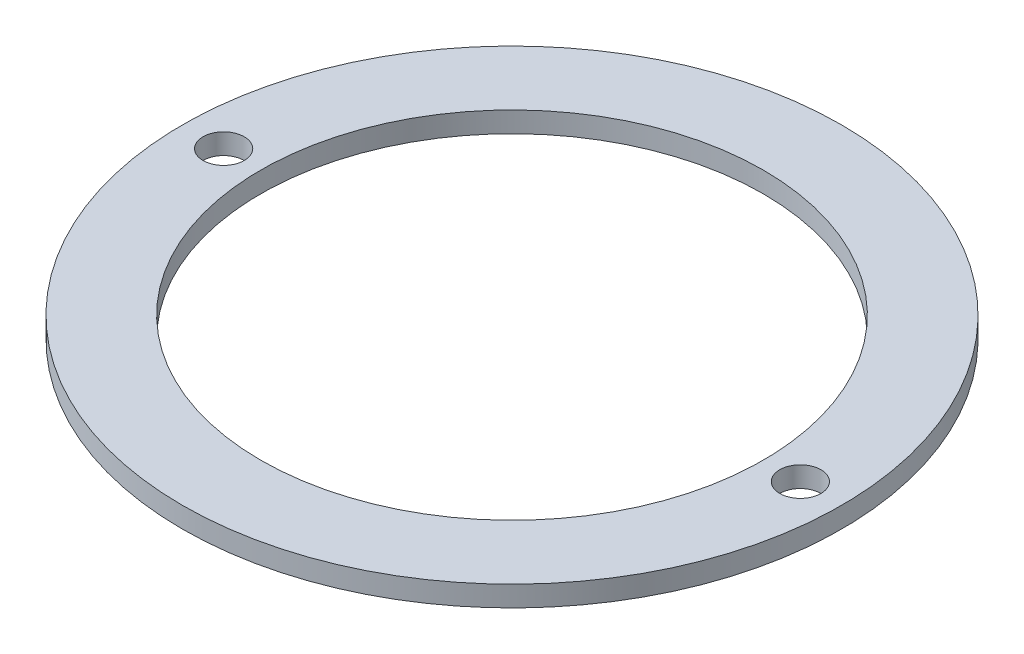
ISO-10303-21;
HEADER;
FILE_DESCRIPTION(('STEP AP214'),'2;1');
FILE_NAME('part.step','',(''),(''),'','','');
FILE_SCHEMA(('AUTOMOTIVE_DESIGN { 1 0 10303 214 1 1 1 1 }'));
ENDSEC;
DATA;
#1=APPLICATION_CONTEXT('core data for automotive mechanical design processes');
#2=APPLICATION_PROTOCOL_DEFINITION('international standard','automotive_design',2000,#1);
#3=PRODUCT_CONTEXT('',#1,'mechanical');
#4=PRODUCT('Part','Part','',(#3));
#5=PRODUCT_RELATED_PRODUCT_CATEGORY('part','',(#4));
#6=PRODUCT_DEFINITION_FORMATION('','',#4);
#7=PRODUCT_DEFINITION_CONTEXT('part definition',#1,'design');
#8=PRODUCT_DEFINITION('design','',#6,#7);
#9=PRODUCT_DEFINITION_SHAPE('','',#8);
#10=(LENGTH_UNIT() NAMED_UNIT(*) SI_UNIT(.MILLI.,.METRE.));
#11=(NAMED_UNIT(*) PLANE_ANGLE_UNIT() SI_UNIT($,.RADIAN.));
#12=(NAMED_UNIT(*) SI_UNIT($,.STERADIAN.) SOLID_ANGLE_UNIT());
#13=UNCERTAINTY_MEASURE_WITH_UNIT(LENGTH_MEASURE(1.E-05),#10,'distance_accuracy_value','');
#14=(GEOMETRIC_REPRESENTATION_CONTEXT(3) GLOBAL_UNCERTAINTY_ASSIGNED_CONTEXT((#13)) GLOBAL_UNIT_ASSIGNED_CONTEXT((#10,
#11,#12)) REPRESENTATION_CONTEXT('',''));
#15=CARTESIAN_POINT('',(0.,0.,0.));
#16=DIRECTION('',(0.,0.,1.));
#17=DIRECTION('',(1.,0.,0.));
#18=AXIS2_PLACEMENT_3D('',#15,#16,#17);
#19=CARTESIAN_POINT('',(0.,0.5,0.));
#20=DIRECTION('',(0.,-1.,0.));
#21=DIRECTION('',(0.,0.,-1.));
#22=AXIS2_PLACEMENT_3D('',#19,#20,#21);
#23=CYLINDRICAL_SURFACE('',#22,8.);
#24=CARTESIAN_POINT('',(0.,0.5,0.));
#25=DIRECTION('',(0.,1.,0.));
#26=DIRECTION('',(0.,0.,1.));
#27=AXIS2_PLACEMENT_3D('',#24,#25,#26);
#28=CIRCLE('',#27,8.);
#29=CARTESIAN_POINT('',(0.,0.5,8.));
#30=VERTEX_POINT('',#29);
#31=EDGE_CURVE('E12',#30,#30,#28,.T.);
#32=ORIENTED_EDGE('',*,*,#31,.F.);
#33=EDGE_LOOP('',(#32));
#34=FACE_BOUND('',#33,.T.);
#35=CARTESIAN_POINT('',(0.,0.,0.));
#36=DIRECTION('',(0.,1.,0.));
#37=DIRECTION('',(0.,0.,1.));
#38=AXIS2_PLACEMENT_3D('',#35,#36,#37);
#39=CIRCLE('',#38,8.);
#40=CARTESIAN_POINT('',(0.,0.,8.));
#41=VERTEX_POINT('',#40);
#42=EDGE_CURVE('E50',#41,#41,#39,.T.);
#43=ORIENTED_EDGE('',*,*,#42,.T.);
#44=EDGE_LOOP('',(#43));
#45=FACE_BOUND('',#44,.T.);
#46=ADVANCED_FACE('F47',(#34,#45),#23,.T.);
#47=CARTESIAN_POINT('',(0.,0.5,0.));
#48=DIRECTION('',(0.,1.,0.));
#49=DIRECTION('',(0.,0.,1.));
#50=AXIS2_PLACEMENT_3D('',#47,#48,#49);
#51=PLANE('',#50);
#52=CARTESIAN_POINT('',(-7.,0.500000000000002,0.));
#53=DIRECTION('',(0.,1.,0.));
#54=DIRECTION('',(0.,0.,1.));
#55=AXIS2_PLACEMENT_3D('',#52,#53,#54);
#56=CIRCLE('',#55,0.499999999999988);
#57=CARTESIAN_POINT('',(-7.,0.500000000000002,0.499999999999988));
#58=VERTEX_POINT('',#57);
#59=EDGE_CURVE('E73',#58,#58,#56,.T.);
#60=ORIENTED_EDGE('',*,*,#59,.F.);
#61=EDGE_LOOP('',(#60));
#62=FACE_BOUND('',#61,.T.);
#63=CARTESIAN_POINT('',(7.,0.500000000000002,0.));
#64=DIRECTION('',(0.,1.,0.));
#65=DIRECTION('',(0.,0.,1.));
#66=AXIS2_PLACEMENT_3D('',#63,#64,#65);
#67=CIRCLE('',#66,0.499999999999988);
#68=CARTESIAN_POINT('',(7.,0.500000000000002,0.499999999999988));
#69=VERTEX_POINT('',#68);
#70=EDGE_CURVE('E67',#69,#69,#67,.T.);
#71=ORIENTED_EDGE('',*,*,#70,.F.);
#72=EDGE_LOOP('',(#71));
#73=FACE_BOUND('',#72,.T.);
#74=CARTESIAN_POINT('',(0.,0.5,0.));
#75=DIRECTION('',(0.,1.,0.));
#76=DIRECTION('',(0.,0.,1.));
#77=AXIS2_PLACEMENT_3D('',#74,#75,#76);
#78=CIRCLE('',#77,6.1);
#79=CARTESIAN_POINT('',(0.,0.5,6.1));
#80=VERTEX_POINT('',#79);
#81=EDGE_CURVE('E59',#80,#80,#78,.T.);
#82=ORIENTED_EDGE('',*,*,#81,.F.);
#83=EDGE_LOOP('',(#82));
#84=FACE_BOUND('',#83,.T.);
#85=ORIENTED_EDGE('',*,*,#31,.T.);
#86=EDGE_LOOP('',(#85));
#87=FACE_BOUND('',#86,.T.);
#88=ADVANCED_FACE('F79',(#62,#73,#84,#87),#51,.T.);
#89=CARTESIAN_POINT('',(0.,0.,0.));
#90=DIRECTION('',(0.,1.,0.));
#91=DIRECTION('',(0.,0.,1.));
#92=AXIS2_PLACEMENT_3D('',#89,#90,#91);
#93=PLANE('',#92);
#94=CARTESIAN_POINT('',(-7.,0.,0.));
#95=DIRECTION('',(0.,1.,0.));
#96=DIRECTION('',(0.,0.,1.));
#97=AXIS2_PLACEMENT_3D('',#94,#95,#96);
#98=CIRCLE('',#97,0.499999999999994);
#99=CARTESIAN_POINT('',(-7.,0.,0.499999999999994));
#100=VERTEX_POINT('',#99);
#101=EDGE_CURVE('E70',#100,#100,#98,.T.);
#102=ORIENTED_EDGE('',*,*,#101,.T.);
#103=EDGE_LOOP('',(#102));
#104=FACE_BOUND('',#103,.T.);
#105=CARTESIAN_POINT('',(7.,0.,0.));
#106=DIRECTION('',(0.,1.,0.));
#107=DIRECTION('',(0.,0.,1.));
#108=AXIS2_PLACEMENT_3D('',#105,#106,#107);
#109=CIRCLE('',#108,0.499999999999994);
#110=CARTESIAN_POINT('',(7.,0.,0.499999999999994));
#111=VERTEX_POINT('',#110);
#112=EDGE_CURVE('E62',#111,#111,#109,.T.);
#113=ORIENTED_EDGE('',*,*,#112,.T.);
#114=EDGE_LOOP('',(#113));
#115=FACE_BOUND('',#114,.T.);
#116=CARTESIAN_POINT('',(0.,0.,0.));
#117=DIRECTION('',(0.,1.,0.));
#118=DIRECTION('',(0.,0.,1.));
#119=AXIS2_PLACEMENT_3D('',#116,#117,#118);
#120=CIRCLE('',#119,6.1);
#121=CARTESIAN_POINT('',(0.,0.,6.1));
#122=VERTEX_POINT('',#121);
#123=EDGE_CURVE('E57',#122,#122,#120,.T.);
#124=ORIENTED_EDGE('',*,*,#123,.T.);
#125=EDGE_LOOP('',(#124));
#126=FACE_BOUND('',#125,.T.);
#127=ORIENTED_EDGE('',*,*,#42,.F.);
#128=EDGE_LOOP('',(#127));
#129=FACE_BOUND('',#128,.T.);
#130=ADVANCED_FACE('F82',(#104,#115,#126,#129),#93,.F.);
#131=CARTESIAN_POINT('',(0.,0.,0.));
#132=DIRECTION('',(0.,1.,0.));
#133=DIRECTION('',(0.,0.,1.));
#134=AXIS2_PLACEMENT_3D('',#131,#132,#133);
#135=CYLINDRICAL_SURFACE('',#134,6.1);
#136=ORIENTED_EDGE('',*,*,#123,.F.);
#137=EDGE_LOOP('',(#136));
#138=FACE_BOUND('',#137,.T.);
#139=ORIENTED_EDGE('',*,*,#81,.T.);
#140=EDGE_LOOP('',(#139));
#141=FACE_BOUND('',#140,.T.);
#142=ADVANCED_FACE('F88',(#138,#141),#135,.F.);
#143=CARTESIAN_POINT('',(7.,0.5,0.));
#144=DIRECTION('',(0.,1.,0.));
#145=DIRECTION('',(0.,0.,1.));
#146=AXIS2_PLACEMENT_3D('',#143,#144,#145);
#147=CYLINDRICAL_SURFACE('',#146,0.499999999999994);
#148=ORIENTED_EDGE('',*,*,#112,.F.);
#149=EDGE_LOOP('',(#148));
#150=FACE_BOUND('',#149,.T.);
#151=ORIENTED_EDGE('',*,*,#70,.T.);
#152=EDGE_LOOP('',(#151));
#153=FACE_BOUND('',#152,.T.);
#154=ADVANCED_FACE('F90',(#150,#153),#147,.F.);
#155=CARTESIAN_POINT('',(-7.,0.5,0.));
#156=DIRECTION('',(0.,1.,0.));
#157=DIRECTION('',(0.,0.,1.));
#158=AXIS2_PLACEMENT_3D('',#155,#156,#157);
#159=CYLINDRICAL_SURFACE('',#158,0.499999999999994);
#160=ORIENTED_EDGE('',*,*,#101,.F.);
#161=EDGE_LOOP('',(#160));
#162=FACE_BOUND('',#161,.T.);
#163=ORIENTED_EDGE('',*,*,#59,.T.);
#164=EDGE_LOOP('',(#163));
#165=FACE_BOUND('',#164,.T.);
#166=ADVANCED_FACE('F77',(#162,#165),#159,.F.);
#167=CLOSED_SHELL('',(#46,#88,#130,#142,#154,#166));
#168=MANIFOLD_SOLID_BREP('B2',#167);
#169=ADVANCED_BREP_SHAPE_REPRESENTATION('',(#18,#168),#14);
#170=SHAPE_DEFINITION_REPRESENTATION(#9,#169);
ENDSEC;
END-ISO-10303-21;
